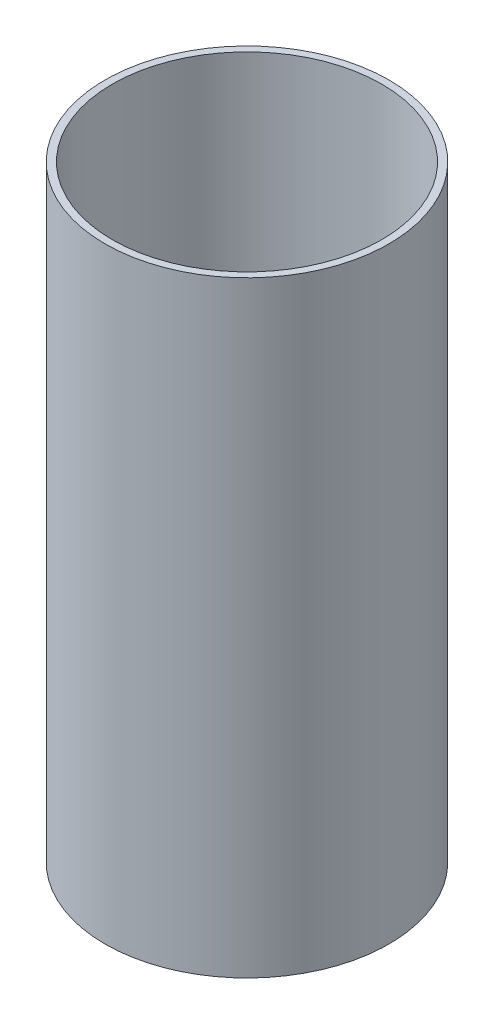
ISO-10303-21;
HEADER;
FILE_DESCRIPTION(('STEP AP214'),'2;1');
FILE_NAME('part.step','',(''),(''),'','','');
FILE_SCHEMA(('AUTOMOTIVE_DESIGN { 1 0 10303 214 1 1 1 1 }'));
ENDSEC;
DATA;
#1=APPLICATION_CONTEXT('core data for automotive mechanical design processes');
#2=APPLICATION_PROTOCOL_DEFINITION('international standard','automotive_design',2000,#1);
#3=PRODUCT_CONTEXT('',#1,'mechanical');
#4=PRODUCT('Part','Part','',(#3));
#5=PRODUCT_RELATED_PRODUCT_CATEGORY('part','',(#4));
#6=PRODUCT_DEFINITION_FORMATION('','',#4);
#7=PRODUCT_DEFINITION_CONTEXT('part definition',#1,'design');
#8=PRODUCT_DEFINITION('design','',#6,#7);
#9=PRODUCT_DEFINITION_SHAPE('','',#8);
#10=(LENGTH_UNIT() NAMED_UNIT(*) SI_UNIT(.MILLI.,.METRE.));
#11=(NAMED_UNIT(*) PLANE_ANGLE_UNIT() SI_UNIT($,.RADIAN.));
#12=(NAMED_UNIT(*) SI_UNIT($,.STERADIAN.) SOLID_ANGLE_UNIT());
#13=UNCERTAINTY_MEASURE_WITH_UNIT(LENGTH_MEASURE(1.E-05),#10,'distance_accuracy_value','');
#14=(GEOMETRIC_REPRESENTATION_CONTEXT(3) GLOBAL_UNCERTAINTY_ASSIGNED_CONTEXT((#13)) GLOBAL_UNIT_ASSIGNED_CONTEXT((#10,
#11,#12)) REPRESENTATION_CONTEXT('',''));
#15=CARTESIAN_POINT('',(0.,0.,0.));
#16=DIRECTION('',(0.,0.,1.));
#17=DIRECTION('',(1.,0.,0.));
#18=AXIS2_PLACEMENT_3D('',#15,#16,#17);
#19=CARTESIAN_POINT('',(0.,200.025,0.));
#20=DIRECTION('',(0.,1.,0.));
#21=DIRECTION('',(0.,0.,1.));
#22=AXIS2_PLACEMENT_3D('',#19,#20,#21);
#23=PLANE('',#22);
#24=CARTESIAN_POINT('',(0.,200.025,0.));
#25=DIRECTION('',(0.,1.,0.));
#26=DIRECTION('',(0.,0.,1.));
#27=AXIS2_PLACEMENT_3D('',#24,#25,#26);
#28=CIRCLE('',#27,93.6625);
#29=CARTESIAN_POINT('',(0.,200.025,93.6625));
#30=VERTEX_POINT('',#29);
#31=EDGE_CURVE('E10',#30,#30,#28,.T.);
#32=ORIENTED_EDGE('',*,*,#31,.T.);
#33=EDGE_LOOP('',(#32));
#34=FACE_BOUND('',#33,.T.);
#35=CARTESIAN_POINT('',(0.,200.025,0.));
#36=DIRECTION('',(0.,1.,0.));
#37=DIRECTION('',(0.,0.,1.));
#38=AXIS2_PLACEMENT_3D('',#35,#36,#37);
#39=CIRCLE('',#38,88.9);
#40=CARTESIAN_POINT('',(0.,200.025,88.9));
#41=VERTEX_POINT('',#40);
#42=EDGE_CURVE('E45',#41,#41,#39,.T.);
#43=ORIENTED_EDGE('',*,*,#42,.F.);
#44=EDGE_LOOP('',(#43));
#45=FACE_BOUND('',#44,.T.);
#46=ADVANCED_FACE('F34',(#34,#45),#23,.T.);
#47=CARTESIAN_POINT('',(0.,-200.025,0.));
#48=DIRECTION('',(0.,1.,0.));
#49=DIRECTION('',(0.,0.,1.));
#50=AXIS2_PLACEMENT_3D('',#47,#48,#49);
#51=PLANE('',#50);
#52=CARTESIAN_POINT('',(0.,-200.025,0.));
#53=DIRECTION('',(0.,1.,0.));
#54=DIRECTION('',(0.,0.,1.));
#55=AXIS2_PLACEMENT_3D('',#52,#53,#54);
#56=CIRCLE('',#55,93.6625);
#57=CARTESIAN_POINT('',(0.,-200.025,93.6625));
#58=VERTEX_POINT('',#57);
#59=EDGE_CURVE('E38',#58,#58,#56,.T.);
#60=ORIENTED_EDGE('',*,*,#59,.F.);
#61=EDGE_LOOP('',(#60));
#62=FACE_BOUND('',#61,.T.);
#63=CARTESIAN_POINT('',(0.,-200.025,0.));
#64=DIRECTION('',(0.,1.,0.));
#65=DIRECTION('',(0.,0.,1.));
#66=AXIS2_PLACEMENT_3D('',#63,#64,#65);
#67=CIRCLE('',#66,88.9);
#68=CARTESIAN_POINT('',(0.,-200.025,88.9));
#69=VERTEX_POINT('',#68);
#70=EDGE_CURVE('E47',#69,#69,#67,.T.);
#71=ORIENTED_EDGE('',*,*,#70,.T.);
#72=EDGE_LOOP('',(#71));
#73=FACE_BOUND('',#72,.T.);
#74=ADVANCED_FACE('F57',(#62,#73),#51,.F.);
#75=CARTESIAN_POINT('',(0.,200.025,0.));
#76=DIRECTION('',(0.,-1.,0.));
#77=DIRECTION('',(0.,0.,-1.));
#78=AXIS2_PLACEMENT_3D('',#75,#76,#77);
#79=CYLINDRICAL_SURFACE('',#78,93.6625);
#80=ORIENTED_EDGE('',*,*,#31,.F.);
#81=EDGE_LOOP('',(#80));
#82=FACE_BOUND('',#81,.T.);
#83=ORIENTED_EDGE('',*,*,#59,.T.);
#84=EDGE_LOOP('',(#83));
#85=FACE_BOUND('',#84,.T.);
#86=ADVANCED_FACE('F36',(#82,#85),#79,.T.);
#87=CARTESIAN_POINT('',(0.,200.025,0.));
#88=DIRECTION('',(0.,-1.,0.));
#89=DIRECTION('',(0.,0.,-1.));
#90=AXIS2_PLACEMENT_3D('',#87,#88,#89);
#91=CYLINDRICAL_SURFACE('',#90,88.9);
#92=ORIENTED_EDGE('',*,*,#42,.T.);
#93=EDGE_LOOP('',(#92));
#94=FACE_BOUND('',#93,.T.);
#95=ORIENTED_EDGE('',*,*,#70,.F.);
#96=EDGE_LOOP('',(#95));
#97=FACE_BOUND('',#96,.T.);
#98=ADVANCED_FACE('F53',(#94,#97),#91,.F.);
#99=CLOSED_SHELL('',(#46,#74,#86,#98));
#100=MANIFOLD_SOLID_BREP('B2',#99);
#101=ADVANCED_BREP_SHAPE_REPRESENTATION('',(#18,#100),#14);
#102=SHAPE_DEFINITION_REPRESENTATION(#9,#101);
ENDSEC;
END-ISO-10303-21;
